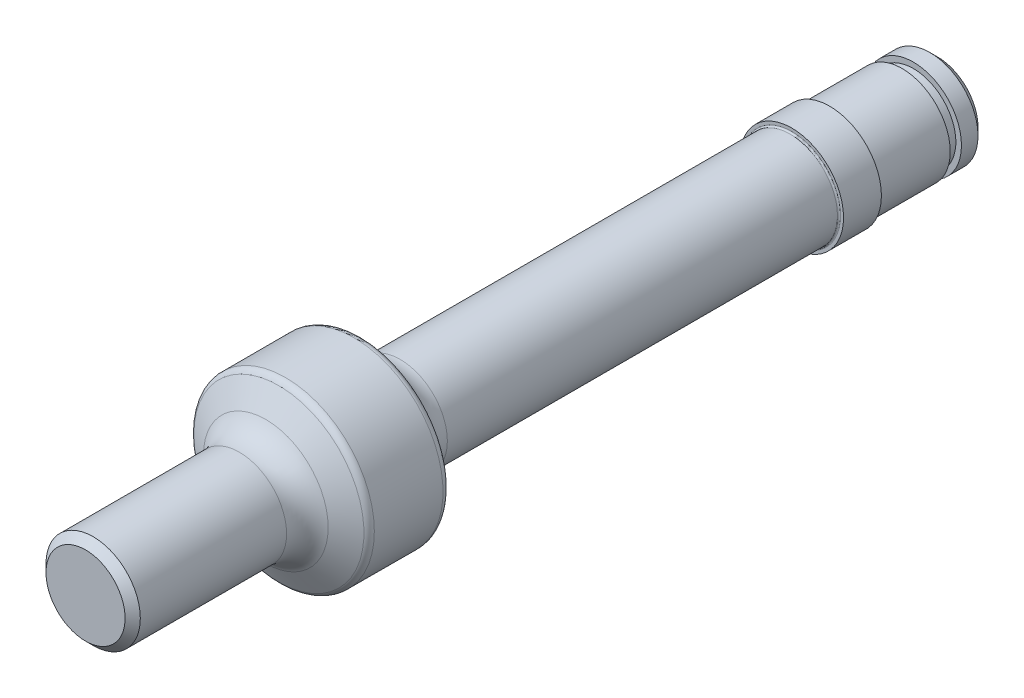
ISO-10303-21;
HEADER;
FILE_DESCRIPTION(('STEP AP214'),'2;1');
FILE_NAME('part.step','',(''),(''),'','','');
FILE_SCHEMA(('AUTOMOTIVE_DESIGN { 1 0 10303 214 1 1 1 1 }'));
ENDSEC;
DATA;
#1=APPLICATION_CONTEXT('core data for automotive mechanical design processes');
#2=APPLICATION_PROTOCOL_DEFINITION('international standard','automotive_design',2000,#1);
#3=PRODUCT_CONTEXT('',#1,'mechanical');
#4=PRODUCT('Part','Part','',(#3));
#5=PRODUCT_RELATED_PRODUCT_CATEGORY('part','',(#4));
#6=PRODUCT_DEFINITION_FORMATION('','',#4);
#7=PRODUCT_DEFINITION_CONTEXT('part definition',#1,'design');
#8=PRODUCT_DEFINITION('design','',#6,#7);
#9=PRODUCT_DEFINITION_SHAPE('','',#8);
#10=(LENGTH_UNIT() NAMED_UNIT(*) SI_UNIT(.MILLI.,.METRE.));
#11=(NAMED_UNIT(*) PLANE_ANGLE_UNIT() SI_UNIT($,.RADIAN.));
#12=(NAMED_UNIT(*) SI_UNIT($,.STERADIAN.) SOLID_ANGLE_UNIT());
#13=UNCERTAINTY_MEASURE_WITH_UNIT(LENGTH_MEASURE(1.E-05),#10,'distance_accuracy_value','');
#14=(GEOMETRIC_REPRESENTATION_CONTEXT(3) GLOBAL_UNCERTAINTY_ASSIGNED_CONTEXT((#13)) GLOBAL_UNIT_ASSIGNED_CONTEXT((#10,
#11,#12)) REPRESENTATION_CONTEXT('',''));
#15=CARTESIAN_POINT('',(0.,0.,0.));
#16=DIRECTION('',(0.,0.,1.));
#17=DIRECTION('',(1.,0.,0.));
#18=AXIS2_PLACEMENT_3D('',#15,#16,#17);
#19=CARTESIAN_POINT('',(0.,3.1623,-40.6019));
#20=DIRECTION('',(0.,0.,1.));
#21=DIRECTION('',(1.,0.,0.));
#22=AXIS2_PLACEMENT_3D('',#19,#20,#21);
#23=PLANE('',#22);
#24=CARTESIAN_POINT('',(0.,0.,-40.6019000000697));
#25=DIRECTION('',(0.,0.,1.));
#26=DIRECTION('',(1.,0.,0.));
#27=AXIS2_PLACEMENT_3D('',#24,#25,#26);
#28=CIRCLE('',#27,2.66229999999723);
#29=CARTESIAN_POINT('',(2.66229999999723,0.,-40.6019000000697));
#30=VERTEX_POINT('',#29);
#31=EDGE_CURVE('E257',#30,#30,#28,.T.);
#32=ORIENTED_EDGE('',*,*,#31,.F.);
#33=EDGE_LOOP('',(#32));
#34=FACE_BOUND('',#33,.T.);
#35=ADVANCED_FACE('F17',(#34),#23,.F.);
#36=CARTESIAN_POINT('',(0.,0.,-40.1019000000247));
#37=DIRECTION('',(0.,0.,1.));
#38=DIRECTION('',(1.,0.,0.));
#39=AXIS2_PLACEMENT_3D('',#36,#37,#38);
#40=CONICAL_SURFACE('',#39,3.16230000004225,0.785398163397448);
#41=ORIENTED_EDGE('',*,*,#31,.T.);
#42=EDGE_LOOP('',(#41));
#43=FACE_BOUND('',#42,.T.);
#44=CARTESIAN_POINT('',(0.,0.,-40.1019));
#45=DIRECTION('',(0.,0.,1.));
#46=DIRECTION('',(1.,0.,0.));
#47=AXIS2_PLACEMENT_3D('',#44,#45,#46);
#48=CIRCLE('',#47,3.1623);
#49=CARTESIAN_POINT('',(3.1623,0.,-40.1019));
#50=VERTEX_POINT('',#49);
#51=EDGE_CURVE('E256',#50,#50,#48,.T.);
#52=ORIENTED_EDGE('',*,*,#51,.F.);
#53=EDGE_LOOP('',(#52));
#54=FACE_BOUND('',#53,.T.);
#55=ADVANCED_FACE('F149',(#43,#54),#40,.T.);
#56=CARTESIAN_POINT('',(0.,0.,26.453846));
#57=DIRECTION('',(0.,0.,1.));
#58=DIRECTION('',(1.,0.,0.));
#59=AXIS2_PLACEMENT_3D('',#56,#57,#58);
#60=CYLINDRICAL_SURFACE('',#59,3.1623);
#61=ORIENTED_EDGE('',*,*,#51,.T.);
#62=EDGE_LOOP('',(#61));
#63=FACE_BOUND('',#62,.T.);
#64=CARTESIAN_POINT('',(0.,0.,-39.0144));
#65=DIRECTION('',(0.,0.,1.));
#66=DIRECTION('',(1.,0.,0.));
#67=AXIS2_PLACEMENT_3D('',#64,#65,#66);
#68=CIRCLE('',#67,3.1623);
#69=CARTESIAN_POINT('',(3.1623,0.,-39.0144));
#70=VERTEX_POINT('',#69);
#71=EDGE_CURVE('E253',#70,#70,#68,.F.);
#72=ORIENTED_EDGE('',*,*,#71,.T.);
#73=EDGE_LOOP('',(#72));
#74=FACE_BOUND('',#73,.T.);
#75=ADVANCED_FACE('F146',(#63,#74),#60,.T.);
#76=CARTESIAN_POINT('',(0.,3.10000000000002,15.3981));
#77=DIRECTION('',(0.,0.,-1.));
#78=DIRECTION('',(-1.,0.,0.));
#79=AXIS2_PLACEMENT_3D('',#76,#77,#78);
#80=PLANE('',#79);
#81=CARTESIAN_POINT('',(0.,0.,15.3980999999703));
#82=DIRECTION('',(0.,0.,-1.));
#83=DIRECTION('',(-1.,0.,0.));
#84=AXIS2_PLACEMENT_3D('',#81,#82,#83);
#85=CIRCLE('',#84,2.59999999991578);
#86=CARTESIAN_POINT('',(-2.59999999991578,0.,15.3980999999703));
#87=VERTEX_POINT('',#86);
#88=EDGE_CURVE('E250',#87,#87,#85,.T.);
#89=ORIENTED_EDGE('',*,*,#88,.F.);
#90=EDGE_LOOP('',(#89));
#91=FACE_BOUND('',#90,.T.);
#92=ADVANCED_FACE('F142',(#91),#80,.F.);
#93=CARTESIAN_POINT('',(0.,2.794,-39.0144));
#94=DIRECTION('',(0.,0.,-1.));
#95=DIRECTION('',(-1.,0.,0.));
#96=AXIS2_PLACEMENT_3D('',#93,#94,#95);
#97=PLANE('',#96);
#98=CARTESIAN_POINT('',(0.,0.,-39.0144));
#99=DIRECTION('',(0.,0.,-1.));
#100=DIRECTION('',(-1.,0.,0.));
#101=AXIS2_PLACEMENT_3D('',#98,#99,#100);
#102=CIRCLE('',#101,2.794);
#103=CARTESIAN_POINT('',(-2.794,0.,-39.0144));
#104=VERTEX_POINT('',#103);
#105=EDGE_CURVE('E247',#104,#104,#102,.F.);
#106=ORIENTED_EDGE('',*,*,#105,.F.);
#107=EDGE_LOOP('',(#106));
#108=FACE_BOUND('',#107,.T.);
#109=ORIENTED_EDGE('',*,*,#71,.F.);
#110=EDGE_LOOP('',(#109));
#111=FACE_BOUND('',#110,.T.);
#112=ADVANCED_FACE('F138',(#108,#111),#97,.F.);
#113=CARTESIAN_POINT('',(0.,0.,14.898100000039));
#114=DIRECTION('',(0.,0.,-1.));
#115=DIRECTION('',(-1.,0.,0.));
#116=AXIS2_PLACEMENT_3D('',#113,#114,#115);
#117=CONICAL_SURFACE('',#116,3.09999999984711,0.785398163397448);
#118=CARTESIAN_POINT('',(0.,0.,14.8981));
#119=DIRECTION('',(0.,0.,1.));
#120=DIRECTION('',(1.,0.,0.));
#121=AXIS2_PLACEMENT_3D('',#118,#119,#120);
#122=CIRCLE('',#121,3.10000000000001);
#123=CARTESIAN_POINT('',(3.10000000000001,0.,14.8981));
#124=VERTEX_POINT('',#123);
#125=EDGE_CURVE('E246',#124,#124,#122,.F.);
#126=ORIENTED_EDGE('',*,*,#125,.F.);
#127=EDGE_LOOP('',(#126));
#128=FACE_BOUND('',#127,.T.);
#129=ORIENTED_EDGE('',*,*,#88,.T.);
#130=EDGE_LOOP('',(#129));
#131=FACE_BOUND('',#130,.T.);
#132=ADVANCED_FACE('F134',(#128,#131),#117,.T.);
#133=CARTESIAN_POINT('',(0.,0.,-40.0654390361338));
#134=DIRECTION('',(0.,0.,-1.));
#135=DIRECTION('',(-1.,0.,0.));
#136=AXIS2_PLACEMENT_3D('',#133,#134,#135);
#137=CYLINDRICAL_SURFACE('',#136,2.794);
#138=ORIENTED_EDGE('',*,*,#105,.T.);
#139=EDGE_LOOP('',(#138));
#140=FACE_BOUND('',#139,.T.);
#141=CARTESIAN_POINT('',(0.,0.,-38.2778));
#142=DIRECTION('',(0.,0.,-1.));
#143=DIRECTION('',(-1.,0.,0.));
#144=AXIS2_PLACEMENT_3D('',#141,#142,#143);
#145=CIRCLE('',#144,2.794);
#146=CARTESIAN_POINT('',(-2.794,0.,-38.2778));
#147=VERTEX_POINT('',#146);
#148=EDGE_CURVE('E243',#147,#147,#145,.T.);
#149=ORIENTED_EDGE('',*,*,#148,.T.);
#150=EDGE_LOOP('',(#149));
#151=FACE_BOUND('',#150,.T.);
#152=ADVANCED_FACE('F130',(#140,#151),#137,.T.);
#153=CARTESIAN_POINT('',(0.,0.,26.453846));
#154=DIRECTION('',(0.,0.,1.));
#155=DIRECTION('',(1.,0.,0.));
#156=AXIS2_PLACEMENT_3D('',#153,#154,#155);
#157=CYLINDRICAL_SURFACE('',#156,3.10000000000001);
#158=CARTESIAN_POINT('',(0.,0.,5.28374149423676));
#159=DIRECTION('',(0.,0.,1.));
#160=DIRECTION('',(1.,0.,0.));
#161=AXIS2_PLACEMENT_3D('',#158,#159,#160);
#162=CIRCLE('',#161,3.10000000000001);
#163=CARTESIAN_POINT('',(3.10000000000001,0.,5.28374149423676));
#164=VERTEX_POINT('',#163);
#165=EDGE_CURVE('E115',#164,#164,#162,.T.);
#166=ORIENTED_EDGE('',*,*,#165,.T.);
#167=EDGE_LOOP('',(#166));
#168=FACE_BOUND('',#167,.T.);
#169=ORIENTED_EDGE('',*,*,#125,.T.);
#170=EDGE_LOOP('',(#169));
#171=FACE_BOUND('',#170,.T.);
#172=ADVANCED_FACE('F126',(#168,#171),#157,.T.);
#173=CARTESIAN_POINT('',(0.,2.794,-38.2778));
#174=DIRECTION('',(0.,0.,1.));
#175=DIRECTION('',(1.,0.,0.));
#176=AXIS2_PLACEMENT_3D('',#173,#174,#175);
#177=PLANE('',#176);
#178=CARTESIAN_POINT('',(0.,0.,-38.2778));
#179=DIRECTION('',(0.,0.,1.));
#180=DIRECTION('',(1.,0.,0.));
#181=AXIS2_PLACEMENT_3D('',#178,#179,#180);
#182=CIRCLE('',#181,3.1623);
#183=CARTESIAN_POINT('',(3.1623,0.,-38.2778));
#184=VERTEX_POINT('',#183);
#185=EDGE_CURVE('E110',#184,#184,#182,.T.);
#186=ORIENTED_EDGE('',*,*,#185,.F.);
#187=EDGE_LOOP('',(#186));
#188=FACE_BOUND('',#187,.T.);
#189=ORIENTED_EDGE('',*,*,#148,.F.);
#190=EDGE_LOOP('',(#189));
#191=FACE_BOUND('',#190,.T.);
#192=ADVANCED_FACE('F122',(#188,#191),#177,.F.);
#193=CARTESIAN_POINT('',(0.,0.,5.28374149423676));
#194=DIRECTION('',(0.,0.,1.));
#195=DIRECTION('',(1.,0.,0.));
#196=AXIS2_PLACEMENT_3D('',#193,#194,#195);
#197=TOROIDAL_SURFACE('',#196,5.10000000000001,2.);
#198=CARTESIAN_POINT('',(0.,0.,3.55169068666328));
#199=DIRECTION('',(0.,0.,-1.));
#200=DIRECTION('',(-1.,0.,0.));
#201=AXIS2_PLACEMENT_3D('',#198,#199,#200);
#202=CIRCLE('',#201,4.099999999994);
#203=CARTESIAN_POINT('',(-4.099999999994,0.,3.55169068666328));
#204=VERTEX_POINT('',#203);
#205=EDGE_CURVE('E102',#204,#204,#202,.T.);
#206=ORIENTED_EDGE('',*,*,#205,.F.);
#207=EDGE_LOOP('',(#206));
#208=FACE_BOUND('',#207,.T.);
#209=ORIENTED_EDGE('',*,*,#165,.F.);
#210=EDGE_LOOP('',(#209));
#211=FACE_BOUND('',#210,.T.);
#212=ADVANCED_FACE('F118',(#208,#211),#197,.F.);
#213=CARTESIAN_POINT('',(0.,0.,26.453846));
#214=DIRECTION('',(0.,0.,1.));
#215=DIRECTION('',(1.,0.,0.));
#216=AXIS2_PLACEMENT_3D('',#213,#214,#215);
#217=CYLINDRICAL_SURFACE('',#216,3.1623);
#218=CARTESIAN_POINT('',(0.,0.,-33.6153));
#219=DIRECTION('',(0.,0.,1.));
#220=DIRECTION('',(1.,0.,0.));
#221=AXIS2_PLACEMENT_3D('',#218,#219,#220);
#222=CIRCLE('',#221,3.1623);
#223=CARTESIAN_POINT('',(3.1623,0.,-33.6153));
#224=VERTEX_POINT('',#223);
#225=EDGE_CURVE('E91',#224,#224,#222,.F.);
#226=ORIENTED_EDGE('',*,*,#225,.T.);
#227=EDGE_LOOP('',(#226));
#228=FACE_BOUND('',#227,.T.);
#229=ORIENTED_EDGE('',*,*,#185,.T.);
#230=EDGE_LOOP('',(#229));
#231=FACE_BOUND('',#230,.T.);
#232=ADVANCED_FACE('F121',(#228,#231),#217,.T.);
#233=CARTESIAN_POINT('',(0.,0.,2.69028408507666));
#234=DIRECTION('',(0.,0.,-1.));
#235=DIRECTION('',(-1.,0.,0.));
#236=AXIS2_PLACEMENT_3D('',#233,#234,#235);
#237=CONICAL_SURFACE('',#236,5.59199999992188,1.04719755119794);
#238=CARTESIAN_POINT('',(0.,0.,2.69028408503697));
#239=DIRECTION('',(0.,0.,-1.));
#240=DIRECTION('',(-1.,0.,0.));
#241=AXIS2_PLACEMENT_3D('',#238,#239,#240);
#242=CIRCLE('',#241,5.59199999999999);
#243=CARTESIAN_POINT('',(-5.59199999999999,0.,2.69028408503697));
#244=VERTEX_POINT('',#243);
#245=EDGE_CURVE('E58',#244,#244,#242,.T.);
#246=ORIENTED_EDGE('',*,*,#245,.F.);
#247=EDGE_LOOP('',(#246));
#248=FACE_BOUND('',#247,.T.);
#249=ORIENTED_EDGE('',*,*,#205,.T.);
#250=EDGE_LOOP('',(#249));
#251=FACE_BOUND('',#250,.T.);
#252=ADVANCED_FACE('F96',(#248,#251),#237,.T.);
#253=CARTESIAN_POINT('',(0.,0.,-33.6153));
#254=DIRECTION('',(0.,0.,1.));
#255=DIRECTION('',(1.,0.,0.));
#256=AXIS2_PLACEMENT_3D('',#253,#254,#255);
#257=TOROIDAL_SURFACE('',#256,3.2623,0.1);
#258=CARTESIAN_POINT('',(0.,0.,-33.5153));
#259=DIRECTION('',(0.,0.,-1.));
#260=DIRECTION('',(-1.,0.,0.));
#261=AXIS2_PLACEMENT_3D('',#258,#259,#260);
#262=CIRCLE('',#261,3.2623);
#263=CARTESIAN_POINT('',(-3.2623,0.,-33.5153));
#264=VERTEX_POINT('',#263);
#265=CARTESIAN_POINT('',(3.2623,0.,-33.5153));
#266=VERTEX_POINT('',#265);
#267=EDGE_CURVE('E47',#264,#266,#262,.T.);
#268=ORIENTED_EDGE('',*,*,#267,.T.);
#269=CARTESIAN_POINT('',(0.,0.,-33.5153));
#270=DIRECTION('',(0.,0.,-1.));
#271=DIRECTION('',(1.,0.,0.));
#272=AXIS2_PLACEMENT_3D('',#269,#270,#271);
#273=CIRCLE('',#272,3.2623);
#274=EDGE_CURVE('E45',#266,#264,#273,.T.);
#275=ORIENTED_EDGE('',*,*,#274,.T.);
#276=EDGE_LOOP('',(#268,#275));
#277=FACE_BOUND('',#276,.T.);
#278=ORIENTED_EDGE('',*,*,#225,.F.);
#279=EDGE_LOOP('',(#278));
#280=FACE_BOUND('',#279,.T.);
#281=ADVANCED_FACE('F49',(#277,#280),#257,.F.);
#282=CARTESIAN_POINT('',(0.,0.,2.25727138314476));
#283=DIRECTION('',(0.,0.,-1.));
#284=DIRECTION('',(-1.,0.,0.));
#285=AXIS2_PLACEMENT_3D('',#282,#283,#284);
#286=TOROIDAL_SURFACE('',#285,5.34199999999999,0.5);
#287=CARTESIAN_POINT('',(0.,0.,2.25727138314476));
#288=DIRECTION('',(0.,0.,1.));
#289=DIRECTION('',(1.,0.,0.));
#290=AXIS2_PLACEMENT_3D('',#287,#288,#289);
#291=CIRCLE('',#290,5.842);
#292=CARTESIAN_POINT('',(5.842,0.,2.25727138314476));
#293=VERTEX_POINT('',#292);
#294=EDGE_CURVE('E53',#293,#293,#291,.F.);
#295=ORIENTED_EDGE('',*,*,#294,.F.);
#296=EDGE_LOOP('',(#295));
#297=FACE_BOUND('',#296,.T.);
#298=ORIENTED_EDGE('',*,*,#245,.T.);
#299=EDGE_LOOP('',(#298));
#300=FACE_BOUND('',#299,.T.);
#301=ADVANCED_FACE('F76',(#297,#300),#286,.T.);
#302=CARTESIAN_POINT('',(0.,3.4,-33.5153));
#303=DIRECTION('',(0.,0.,1.));
#304=DIRECTION('',(1.,0.,0.));
#305=AXIS2_PLACEMENT_3D('',#302,#303,#304);
#306=PLANE('',#305);
#307=CARTESIAN_POINT('',(0.,0.,-33.5153));
#308=DIRECTION('',(0.,0.,1.));
#309=DIRECTION('',(1.,0.,0.));
#310=AXIS2_PLACEMENT_3D('',#307,#308,#309);
#311=CIRCLE('',#310,3.4);
#312=CARTESIAN_POINT('',(3.4,0.,-33.5153));
#313=VERTEX_POINT('',#312);
#314=EDGE_CURVE('E229',#313,#313,#311,.T.);
#315=ORIENTED_EDGE('',*,*,#314,.F.);
#316=EDGE_LOOP('',(#315));
#317=FACE_BOUND('',#316,.T.);
#318=ORIENTED_EDGE('',*,*,#274,.F.);
#319=ORIENTED_EDGE('',*,*,#267,.F.);
#320=EDGE_LOOP('',(#318,#319));
#321=FACE_BOUND('',#320,.T.);
#322=ADVANCED_FACE('F57',(#317,#321),#306,.F.);
#323=CARTESIAN_POINT('',(0.,0.,26.453846));
#324=DIRECTION('',(0.,0.,1.));
#325=DIRECTION('',(1.,0.,0.));
#326=AXIS2_PLACEMENT_3D('',#323,#324,#325);
#327=CYLINDRICAL_SURFACE('',#326,5.842);
#328=CARTESIAN_POINT('',(0.,0.,-2.25727138314476));
#329=DIRECTION('',(0.,0.,-1.));
#330=DIRECTION('',(-1.,0.,0.));
#331=AXIS2_PLACEMENT_3D('',#328,#329,#330);
#332=CIRCLE('',#331,5.842);
#333=CARTESIAN_POINT('',(-5.842,0.,-2.25727138314476));
#334=VERTEX_POINT('',#333);
#335=EDGE_CURVE('E226',#334,#334,#332,.T.);
#336=ORIENTED_EDGE('',*,*,#335,.F.);
#337=EDGE_LOOP('',(#336));
#338=FACE_BOUND('',#337,.T.);
#339=ORIENTED_EDGE('',*,*,#294,.T.);
#340=EDGE_LOOP('',(#339));
#341=FACE_BOUND('',#340,.T.);
#342=ADVANCED_FACE('F75',(#338,#341),#327,.T.);
#343=CARTESIAN_POINT('',(0.,0.,26.453846));
#344=DIRECTION('',(0.,0.,1.));
#345=DIRECTION('',(1.,0.,0.));
#346=AXIS2_PLACEMENT_3D('',#343,#344,#345);
#347=CYLINDRICAL_SURFACE('',#346,3.4);
#348=CARTESIAN_POINT('',(0.,0.,-31.0261));
#349=DIRECTION('',(0.,0.,1.));
#350=DIRECTION('',(1.,0.,0.));
#351=AXIS2_PLACEMENT_3D('',#348,#349,#350);
#352=CIRCLE('',#351,3.4);
#353=CARTESIAN_POINT('',(3.4,0.,-31.0261));
#354=VERTEX_POINT('',#353);
#355=EDGE_CURVE('E228',#354,#354,#352,.F.);
#356=ORIENTED_EDGE('',*,*,#355,.T.);
#357=EDGE_LOOP('',(#356));
#358=FACE_BOUND('',#357,.T.);
#359=ORIENTED_EDGE('',*,*,#314,.T.);
#360=EDGE_LOOP('',(#359));
#361=FACE_BOUND('',#360,.T.);
#362=ADVANCED_FACE('F282',(#358,#361),#347,.T.);
#363=CARTESIAN_POINT('',(0.,0.,-2.25727138314476));
#364=DIRECTION('',(0.,0.,-1.));
#365=DIRECTION('',(-1.,0.,0.));
#366=AXIS2_PLACEMENT_3D('',#363,#364,#365);
#367=TOROIDAL_SURFACE('',#366,5.34199999999999,0.5);
#368=CARTESIAN_POINT('',(0.,0.,-2.69028408501981));
#369=DIRECTION('',(0.,0.,1.));
#370=DIRECTION('',(1.,0.,0.));
#371=AXIS2_PLACEMENT_3D('',#368,#369,#370);
#372=CIRCLE('',#371,5.59199999997873);
#373=CARTESIAN_POINT('',(5.59199999997872,0.,-2.69028408501981));
#374=VERTEX_POINT('',#373);
#375=EDGE_CURVE('E185',#374,#374,#372,.F.);
#376=ORIENTED_EDGE('',*,*,#375,.F.);
#377=EDGE_LOOP('',(#376));
#378=FACE_BOUND('',#377,.T.);
#379=ORIENTED_EDGE('',*,*,#335,.T.);
#380=EDGE_LOOP('',(#379));
#381=FACE_BOUND('',#380,.T.);
#382=ADVANCED_FACE('F203',(#378,#381),#367,.T.);
#383=CARTESIAN_POINT('',(0.,3.4,-31.0261));
#384=DIRECTION('',(0.,0.,-1.));
#385=DIRECTION('',(-1.,0.,0.));
#386=AXIS2_PLACEMENT_3D('',#383,#384,#385);
#387=PLANE('',#386);
#388=ORIENTED_EDGE('',*,*,#355,.F.);
#389=EDGE_LOOP('',(#388));
#390=FACE_BOUND('',#389,.T.);
#391=CARTESIAN_POINT('',(0.,0.,-31.0261));
#392=DIRECTION('',(0.,0.,1.));
#393=DIRECTION('',(-1.,0.,0.));
#394=AXIS2_PLACEMENT_3D('',#391,#392,#393);
#395=CIRCLE('',#394,3.19999999999995);
#396=CARTESIAN_POINT('',(3.19999999999995,0.,-31.0261));
#397=VERTEX_POINT('',#396);
#398=CARTESIAN_POINT('',(-3.19999999999995,0.,-31.0261));
#399=VERTEX_POINT('',#398);
#400=EDGE_CURVE('E182',#397,#399,#395,.F.);
#401=ORIENTED_EDGE('',*,*,#400,.T.);
#402=CARTESIAN_POINT('',(0.,0.,-31.0261));
#403=DIRECTION('',(0.,0.,1.));
#404=DIRECTION('',(1.,0.,0.));
#405=AXIS2_PLACEMENT_3D('',#402,#403,#404);
#406=CIRCLE('',#405,3.19999999999995);
#407=EDGE_CURVE('E36',#399,#397,#406,.F.);
#408=ORIENTED_EDGE('',*,*,#407,.T.);
#409=EDGE_LOOP('',(#401,#408));
#410=FACE_BOUND('',#409,.T.);
#411=ADVANCED_FACE('F193',(#390,#410),#387,.F.);
#412=CARTESIAN_POINT('',(0.,0.,-2.69028408507666));
#413=DIRECTION('',(0.,0.,1.));
#414=DIRECTION('',(1.,0.,0.));
#415=AXIS2_PLACEMENT_3D('',#412,#413,#414);
#416=CONICAL_SURFACE('',#415,5.59199999992188,1.04719755119794);
#417=ORIENTED_EDGE('',*,*,#375,.T.);
#418=EDGE_LOOP('',(#417));
#419=FACE_BOUND('',#418,.T.);
#420=CARTESIAN_POINT('',(0.,0.,-3.55169068666792));
#421=DIRECTION('',(0.,0.,1.));
#422=DIRECTION('',(1.,0.,0.));
#423=AXIS2_PLACEMENT_3D('',#420,#421,#422);
#424=CIRCLE('',#423,4.09999999999995);
#425=CARTESIAN_POINT('',(4.09999999999995,0.,-3.55169068666792));
#426=VERTEX_POINT('',#425);
#427=EDGE_CURVE('E180',#426,#426,#424,.T.);
#428=ORIENTED_EDGE('',*,*,#427,.T.);
#429=EDGE_LOOP('',(#428));
#430=FACE_BOUND('',#429,.T.);
#431=ADVANCED_FACE('F202',(#419,#430),#416,.T.);
#432=CARTESIAN_POINT('',(0.,0.,-30.9261));
#433=DIRECTION('',(0.,0.,-1.));
#434=DIRECTION('',(-1.,0.,0.));
#435=AXIS2_PLACEMENT_3D('',#432,#433,#434);
#436=TOROIDAL_SURFACE('',#435,3.19999999999995,0.1);
#437=CARTESIAN_POINT('',(0.,0.,-30.9261));
#438=DIRECTION('',(0.,0.,1.));
#439=DIRECTION('',(1.,0.,0.));
#440=AXIS2_PLACEMENT_3D('',#437,#438,#439);
#441=CIRCLE('',#440,3.09999999999995);
#442=CARTESIAN_POINT('',(3.09999999999995,0.,-30.9261));
#443=VERTEX_POINT('',#442);
#444=EDGE_CURVE('E28',#443,#443,#441,.T.);
#445=ORIENTED_EDGE('',*,*,#444,.F.);
#446=EDGE_LOOP('',(#445));
#447=FACE_BOUND('',#446,.T.);
#448=ORIENTED_EDGE('',*,*,#400,.F.);
#449=ORIENTED_EDGE('',*,*,#407,.F.);
#450=EDGE_LOOP('',(#448,#449));
#451=FACE_BOUND('',#450,.T.);
#452=ADVANCED_FACE('F168',(#447,#451),#436,.F.);
#453=CARTESIAN_POINT('',(0.,0.,-5.2837414942368));
#454=DIRECTION('',(0.,0.,1.));
#455=DIRECTION('',(1.,0.,0.));
#456=AXIS2_PLACEMENT_3D('',#453,#454,#455);
#457=TOROIDAL_SURFACE('',#456,5.09999999999995,2.);
#458=CARTESIAN_POINT('',(0.,0.,-5.2837414942368));
#459=DIRECTION('',(0.,0.,1.));
#460=DIRECTION('',(1.,0.,0.));
#461=AXIS2_PLACEMENT_3D('',#458,#459,#460);
#462=CIRCLE('',#461,3.09999999999995);
#463=CARTESIAN_POINT('',(3.09999999999995,0.,-5.2837414942368));
#464=VERTEX_POINT('',#463);
#465=EDGE_CURVE('E11',#464,#464,#462,.F.);
#466=ORIENTED_EDGE('',*,*,#465,.F.);
#467=EDGE_LOOP('',(#466));
#468=FACE_BOUND('',#467,.T.);
#469=ORIENTED_EDGE('',*,*,#427,.F.);
#470=EDGE_LOOP('',(#469));
#471=FACE_BOUND('',#470,.T.);
#472=ADVANCED_FACE('F162',(#468,#471),#457,.F.);
#473=CARTESIAN_POINT('',(0.,0.,26.453846));
#474=DIRECTION('',(0.,0.,1.));
#475=DIRECTION('',(1.,0.,0.));
#476=AXIS2_PLACEMENT_3D('',#473,#474,#475);
#477=CYLINDRICAL_SURFACE('',#476,3.09999999999995);
#478=ORIENTED_EDGE('',*,*,#444,.T.);
#479=EDGE_LOOP('',(#478));
#480=FACE_BOUND('',#479,.T.);
#481=ORIENTED_EDGE('',*,*,#465,.T.);
#482=EDGE_LOOP('',(#481));
#483=FACE_BOUND('',#482,.T.);
#484=ADVANCED_FACE('F160',(#480,#483),#477,.T.);
#485=CLOSED_SHELL('',(#35,#55,#75,#92,#112,#132,#152,#172,#192,#212,#232,#252,#281,#301,#322,
#342,#362,#382,#411,#431,#452,#472,#484));
#486=MANIFOLD_SOLID_BREP('B1',#485);
#487=ADVANCED_BREP_SHAPE_REPRESENTATION('',(#18,#486),#14);
#488=SHAPE_DEFINITION_REPRESENTATION(#9,#487);
ENDSEC;
END-ISO-10303-21;
